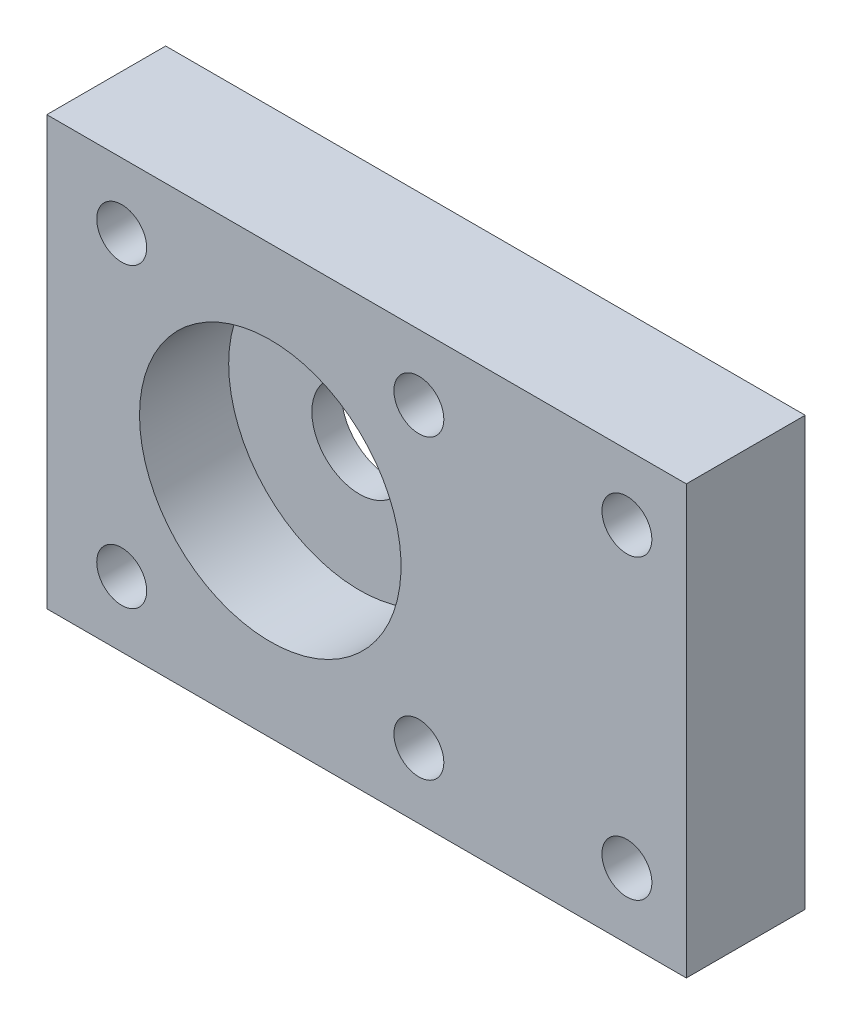
ISO-10303-21;
HEADER;
FILE_DESCRIPTION(('STEP AP214'),'2;1');
FILE_NAME('part.step','',(''),(''),'','','');
FILE_SCHEMA(('AUTOMOTIVE_DESIGN { 1 0 10303 214 1 1 1 1 }'));
ENDSEC;
DATA;
#1=APPLICATION_CONTEXT('core data for automotive mechanical design processes');
#2=APPLICATION_PROTOCOL_DEFINITION('international standard','automotive_design',2000,#1);
#3=PRODUCT_CONTEXT('',#1,'mechanical');
#4=PRODUCT('Part','Part','',(#3));
#5=PRODUCT_RELATED_PRODUCT_CATEGORY('part','',(#4));
#6=PRODUCT_DEFINITION_FORMATION('','',#4);
#7=PRODUCT_DEFINITION_CONTEXT('part definition',#1,'design');
#8=PRODUCT_DEFINITION('design','',#6,#7);
#9=PRODUCT_DEFINITION_SHAPE('','',#8);
#10=(LENGTH_UNIT() NAMED_UNIT(*) SI_UNIT(.MILLI.,.METRE.));
#11=(NAMED_UNIT(*) PLANE_ANGLE_UNIT() SI_UNIT($,.RADIAN.));
#12=(NAMED_UNIT(*) SI_UNIT($,.STERADIAN.) SOLID_ANGLE_UNIT());
#13=UNCERTAINTY_MEASURE_WITH_UNIT(LENGTH_MEASURE(1.E-05),#10,'distance_accuracy_value','');
#14=(GEOMETRIC_REPRESENTATION_CONTEXT(3) GLOBAL_UNCERTAINTY_ASSIGNED_CONTEXT((#13)) GLOBAL_UNIT_ASSIGNED_CONTEXT((#10,
#11,#12)) REPRESENTATION_CONTEXT('',''));
#15=CARTESIAN_POINT('',(0.,0.,0.));
#16=DIRECTION('',(0.,0.,1.));
#17=DIRECTION('',(1.,0.,0.));
#18=AXIS2_PLACEMENT_3D('',#15,#16,#17);
#19=CARTESIAN_POINT('',(0.,0.,-10.));
#20=DIRECTION('',(0.,0.,-1.));
#21=DIRECTION('',(1.,0.,0.));
#22=AXIS2_PLACEMENT_3D('',#19,#20,#21);
#23=PLANE('',#22);
#24=CARTESIAN_POINT('',(-5.,7.49999999999999,-10.));
#25=DIRECTION('',(0.,0.,1.));
#26=DIRECTION('',(-1.,0.,0.));
#27=AXIS2_PLACEMENT_3D('',#24,#25,#26);
#28=CIRCLE('',#27,2.1);
#29=CARTESIAN_POINT('',(-7.09999999999999,7.49999999999999,-10.));
#30=VERTEX_POINT('',#29);
#31=EDGE_CURVE('E116',#30,#30,#28,.T.);
#32=ORIENTED_EDGE('',*,*,#31,.T.);
#33=EDGE_LOOP('',(#32));
#34=FACE_BOUND('',#33,.T.);
#35=CARTESIAN_POINT('',(-22.5,7.5,-10.));
#36=DIRECTION('',(0.,0.,1.));
#37=DIRECTION('',(1.,0.,0.));
#38=AXIS2_PLACEMENT_3D('',#35,#36,#37);
#39=CIRCLE('',#38,2.1);
#40=CARTESIAN_POINT('',(-20.4,7.5,-10.));
#41=VERTEX_POINT('',#40);
#42=EDGE_CURVE('E128',#41,#41,#39,.T.);
#43=ORIENTED_EDGE('',*,*,#42,.T.);
#44=EDGE_LOOP('',(#43));
#45=FACE_BOUND('',#44,.T.);
#46=CARTESIAN_POINT('',(-47.5,7.49999999999998,-10.));
#47=DIRECTION('',(0.,0.,1.));
#48=DIRECTION('',(-1.,0.,0.));
#49=AXIS2_PLACEMENT_3D('',#46,#47,#48);
#50=CIRCLE('',#49,2.1);
#51=CARTESIAN_POINT('',(-49.6,7.49999999999998,-10.));
#52=VERTEX_POINT('',#51);
#53=EDGE_CURVE('E140',#52,#52,#50,.T.);
#54=ORIENTED_EDGE('',*,*,#53,.T.);
#55=EDGE_LOOP('',(#54));
#56=FACE_BOUND('',#55,.T.);
#57=CARTESIAN_POINT('',(-22.5,32.5,-10.));
#58=DIRECTION('',(0.,0.,1.));
#59=DIRECTION('',(1.,0.,0.));
#60=AXIS2_PLACEMENT_3D('',#57,#58,#59);
#61=CIRCLE('',#60,2.1);
#62=CARTESIAN_POINT('',(-20.4,32.5,-10.));
#63=VERTEX_POINT('',#62);
#64=EDGE_CURVE('E91',#63,#63,#61,.T.);
#65=ORIENTED_EDGE('',*,*,#64,.T.);
#66=EDGE_LOOP('',(#65));
#67=FACE_BOUND('',#66,.T.);
#68=CARTESIAN_POINT('',(-47.5,32.5,-10.));
#69=DIRECTION('',(0.,0.,1.));
#70=DIRECTION('',(1.,0.,0.));
#71=AXIS2_PLACEMENT_3D('',#68,#69,#70);
#72=CIRCLE('',#71,2.1);
#73=CARTESIAN_POINT('',(-45.4,32.5,-10.));
#74=VERTEX_POINT('',#73);
#75=EDGE_CURVE('E134',#74,#74,#72,.T.);
#76=ORIENTED_EDGE('',*,*,#75,.T.);
#77=EDGE_LOOP('',(#76));
#78=FACE_BOUND('',#77,.T.);
#79=CARTESIAN_POINT('',(-5.,32.5,-10.));
#80=DIRECTION('',(0.,0.,1.));
#81=DIRECTION('',(1.,0.,0.));
#82=AXIS2_PLACEMENT_3D('',#79,#80,#81);
#83=CIRCLE('',#82,2.1);
#84=CARTESIAN_POINT('',(-2.9,32.5,-10.));
#85=VERTEX_POINT('',#84);
#86=EDGE_CURVE('E122',#85,#85,#83,.T.);
#87=ORIENTED_EDGE('',*,*,#86,.T.);
#88=EDGE_LOOP('',(#87));
#89=FACE_BOUND('',#88,.T.);
#90=CARTESIAN_POINT('',(-35.,20.,-10.));
#91=DIRECTION('',(0.,0.,1.));
#92=DIRECTION('',(1.,0.,0.));
#93=AXIS2_PLACEMENT_3D('',#90,#91,#92);
#94=CIRCLE('',#93,4.);
#95=CARTESIAN_POINT('',(-31.,20.,-10.));
#96=VERTEX_POINT('',#95);
#97=EDGE_CURVE('E112',#96,#96,#94,.T.);
#98=ORIENTED_EDGE('',*,*,#97,.T.);
#99=EDGE_LOOP('',(#98));
#100=FACE_BOUND('',#99,.T.);
#101=DIRECTION('',(0.,1.,0.));
#102=VECTOR('',#101,1.);
#103=CARTESIAN_POINT('',(0.,0.,-10.));
#104=LINE('',#103,#102);
#105=CARTESIAN_POINT('',(0.,2.,-10.));
#106=VERTEX_POINT('',#105);
#107=CARTESIAN_POINT('',(0.,38.,-10.));
#108=VERTEX_POINT('',#107);
#109=EDGE_CURVE('E42',#106,#108,#104,.T.);
#110=ORIENTED_EDGE('',*,*,#109,.F.);
#111=DIRECTION('',(-1.,0.,0.));
#112=VECTOR('',#111,1.);
#113=CARTESIAN_POINT('',(0.,2.,-10.));
#114=LINE('',#113,#112);
#115=CARTESIAN_POINT('',(-53.8,2.,-10.));
#116=VERTEX_POINT('',#115);
#117=EDGE_CURVE('E103',#106,#116,#114,.T.);
#118=ORIENTED_EDGE('',*,*,#117,.T.);
#119=DIRECTION('',(0.,-1.,0.));
#120=VECTOR('',#119,1.);
#121=CARTESIAN_POINT('',(-53.8,0.,-10.));
#122=LINE('',#121,#120);
#123=CARTESIAN_POINT('',(-53.8,38.,-10.));
#124=VERTEX_POINT('',#123);
#125=EDGE_CURVE('E11',#124,#116,#122,.T.);
#126=ORIENTED_EDGE('',*,*,#125,.F.);
#127=DIRECTION('',(1.,0.,0.));
#128=VECTOR('',#127,1.);
#129=CARTESIAN_POINT('',(-53.8,38.,-10.));
#130=LINE('',#129,#128);
#131=EDGE_CURVE('E95',#124,#108,#130,.T.);
#132=ORIENTED_EDGE('',*,*,#131,.T.);
#133=EDGE_LOOP('',(#110,#118,#126,#132));
#134=FACE_BOUND('',#133,.T.);
#135=ADVANCED_FACE('F33',(#34,#45,#56,#67,#78,#89,#100,#134),#23,.T.);
#136=CARTESIAN_POINT('',(0.,0.,0.));
#137=DIRECTION('',(0.,0.,-1.));
#138=DIRECTION('',(1.,0.,0.));
#139=AXIS2_PLACEMENT_3D('',#136,#137,#138);
#140=PLANE('',#139);
#141=CARTESIAN_POINT('',(-34.9999999999993,19.9999999999776,0.));
#142=DIRECTION('',(0.,0.,-1.));
#143=DIRECTION('',(-1.,0.,0.));
#144=AXIS2_PLACEMENT_3D('',#141,#142,#143);
#145=CIRCLE('',#144,11.0000000000071);
#146=CARTESIAN_POINT('',(-46.0000000000064,19.9999999999776,0.));
#147=VERTEX_POINT('',#146);
#148=EDGE_CURVE('E106',#147,#147,#145,.T.);
#149=ORIENTED_EDGE('',*,*,#148,.T.);
#150=EDGE_LOOP('',(#149));
#151=FACE_BOUND('',#150,.T.);
#152=CARTESIAN_POINT('',(-22.5,32.5,0.));
#153=DIRECTION('',(0.,0.,1.));
#154=DIRECTION('',(1.,0.,0.));
#155=AXIS2_PLACEMENT_3D('',#152,#153,#154);
#156=CIRCLE('',#155,2.1);
#157=CARTESIAN_POINT('',(-20.4,32.5,0.));
#158=VERTEX_POINT('',#157);
#159=EDGE_CURVE('E143',#158,#158,#156,.T.);
#160=ORIENTED_EDGE('',*,*,#159,.F.);
#161=EDGE_LOOP('',(#160));
#162=FACE_BOUND('',#161,.T.);
#163=CARTESIAN_POINT('',(-47.5,7.49999999999998,0.));
#164=DIRECTION('',(0.,0.,1.));
#165=DIRECTION('',(-1.,0.,0.));
#166=AXIS2_PLACEMENT_3D('',#163,#164,#165);
#167=CIRCLE('',#166,2.1);
#168=CARTESIAN_POINT('',(-49.6,7.49999999999998,0.));
#169=VERTEX_POINT('',#168);
#170=EDGE_CURVE('E137',#169,#169,#167,.T.);
#171=ORIENTED_EDGE('',*,*,#170,.F.);
#172=EDGE_LOOP('',(#171));
#173=FACE_BOUND('',#172,.T.);
#174=CARTESIAN_POINT('',(-47.5,32.5,0.));
#175=DIRECTION('',(0.,0.,1.));
#176=DIRECTION('',(1.,0.,0.));
#177=AXIS2_PLACEMENT_3D('',#174,#175,#176);
#178=CIRCLE('',#177,2.1);
#179=CARTESIAN_POINT('',(-45.4,32.5,0.));
#180=VERTEX_POINT('',#179);
#181=EDGE_CURVE('E131',#180,#180,#178,.T.);
#182=ORIENTED_EDGE('',*,*,#181,.F.);
#183=EDGE_LOOP('',(#182));
#184=FACE_BOUND('',#183,.T.);
#185=CARTESIAN_POINT('',(-22.5,7.5,0.));
#186=DIRECTION('',(0.,0.,1.));
#187=DIRECTION('',(1.,0.,0.));
#188=AXIS2_PLACEMENT_3D('',#185,#186,#187);
#189=CIRCLE('',#188,2.1);
#190=CARTESIAN_POINT('',(-20.4,7.5,0.));
#191=VERTEX_POINT('',#190);
#192=EDGE_CURVE('E125',#191,#191,#189,.T.);
#193=ORIENTED_EDGE('',*,*,#192,.F.);
#194=EDGE_LOOP('',(#193));
#195=FACE_BOUND('',#194,.T.);
#196=CARTESIAN_POINT('',(-5.,32.5,0.));
#197=DIRECTION('',(0.,0.,1.));
#198=DIRECTION('',(1.,0.,0.));
#199=AXIS2_PLACEMENT_3D('',#196,#197,#198);
#200=CIRCLE('',#199,2.1);
#201=CARTESIAN_POINT('',(-2.9,32.5,0.));
#202=VERTEX_POINT('',#201);
#203=EDGE_CURVE('E119',#202,#202,#200,.T.);
#204=ORIENTED_EDGE('',*,*,#203,.F.);
#205=EDGE_LOOP('',(#204));
#206=FACE_BOUND('',#205,.T.);
#207=CARTESIAN_POINT('',(-5.,7.49999999999999,0.));
#208=DIRECTION('',(0.,0.,1.));
#209=DIRECTION('',(-1.,0.,0.));
#210=AXIS2_PLACEMENT_3D('',#207,#208,#209);
#211=CIRCLE('',#210,2.1);
#212=CARTESIAN_POINT('',(-7.09999999999999,7.49999999999999,0.));
#213=VERTEX_POINT('',#212);
#214=EDGE_CURVE('E115',#213,#213,#211,.T.);
#215=ORIENTED_EDGE('',*,*,#214,.F.);
#216=EDGE_LOOP('',(#215));
#217=FACE_BOUND('',#216,.T.);
#218=DIRECTION('',(-1.,0.,0.));
#219=VECTOR('',#218,1.);
#220=CARTESIAN_POINT('',(0.,38.,0.));
#221=LINE('',#220,#219);
#222=CARTESIAN_POINT('',(0.,38.,0.));
#223=VERTEX_POINT('',#222);
#224=CARTESIAN_POINT('',(-53.8,38.,0.));
#225=VERTEX_POINT('',#224);
#226=EDGE_CURVE('E83',#223,#225,#221,.T.);
#227=ORIENTED_EDGE('',*,*,#226,.T.);
#228=DIRECTION('',(0.,-1.,0.));
#229=VECTOR('',#228,1.);
#230=CARTESIAN_POINT('',(-53.8,0.,0.));
#231=LINE('',#230,#229);
#232=CARTESIAN_POINT('',(-53.8,2.,0.));
#233=VERTEX_POINT('',#232);
#234=EDGE_CURVE('E90',#225,#233,#231,.T.);
#235=ORIENTED_EDGE('',*,*,#234,.T.);
#236=DIRECTION('',(1.,0.,0.));
#237=VECTOR('',#236,1.);
#238=CARTESIAN_POINT('',(-53.8,2.,0.));
#239=LINE('',#238,#237);
#240=CARTESIAN_POINT('',(0.,2.,0.));
#241=VERTEX_POINT('',#240);
#242=EDGE_CURVE('E89',#233,#241,#239,.T.);
#243=ORIENTED_EDGE('',*,*,#242,.T.);
#244=DIRECTION('',(0.,1.,0.));
#245=VECTOR('',#244,1.);
#246=CARTESIAN_POINT('',(0.,0.,0.));
#247=LINE('',#246,#245);
#248=EDGE_CURVE('E79',#241,#223,#247,.T.);
#249=ORIENTED_EDGE('',*,*,#248,.T.);
#250=EDGE_LOOP('',(#227,#235,#243,#249));
#251=FACE_BOUND('',#250,.T.);
#252=ADVANCED_FACE('F87',(#151,#162,#173,#184,#195,#206,#217,#251),#140,.F.);
#253=CARTESIAN_POINT('',(0.,0.,-10.));
#254=DIRECTION('',(-1.,0.,0.));
#255=DIRECTION('',(0.,0.,-1.));
#256=AXIS2_PLACEMENT_3D('',#253,#254,#255);
#257=PLANE('',#256);
#258=DIRECTION('',(0.,0.,1.));
#259=VECTOR('',#258,1.);
#260=CARTESIAN_POINT('',(0.,38.,-10.));
#261=LINE('',#260,#259);
#262=EDGE_CURVE('E77',#108,#223,#261,.T.);
#263=ORIENTED_EDGE('',*,*,#262,.T.);
#264=ORIENTED_EDGE('',*,*,#248,.F.);
#265=DIRECTION('',(0.,0.,-1.));
#266=VECTOR('',#265,1.);
#267=CARTESIAN_POINT('',(0.,2.,0.));
#268=LINE('',#267,#266);
#269=EDGE_CURVE('E101',#241,#106,#268,.T.);
#270=ORIENTED_EDGE('',*,*,#269,.T.);
#271=ORIENTED_EDGE('',*,*,#109,.T.);
#272=EDGE_LOOP('',(#263,#264,#270,#271));
#273=FACE_BOUND('',#272,.T.);
#274=ADVANCED_FACE('F35',(#273),#257,.F.);
#275=CARTESIAN_POINT('',(-53.8,0.,-10.));
#276=DIRECTION('',(1.,0.,0.));
#277=DIRECTION('',(0.,0.,1.));
#278=AXIS2_PLACEMENT_3D('',#275,#276,#277);
#279=PLANE('',#278);
#280=DIRECTION('',(0.,0.,-1.));
#281=VECTOR('',#280,1.);
#282=CARTESIAN_POINT('',(-53.8,38.,0.));
#283=LINE('',#282,#281);
#284=EDGE_CURVE('E50',#225,#124,#283,.T.);
#285=ORIENTED_EDGE('',*,*,#284,.T.);
#286=ORIENTED_EDGE('',*,*,#125,.T.);
#287=DIRECTION('',(0.,0.,1.));
#288=VECTOR('',#287,1.);
#289=CARTESIAN_POINT('',(-53.8,2.,-10.));
#290=LINE('',#289,#288);
#291=EDGE_CURVE('E58',#116,#233,#290,.T.);
#292=ORIENTED_EDGE('',*,*,#291,.T.);
#293=ORIENTED_EDGE('',*,*,#234,.F.);
#294=EDGE_LOOP('',(#285,#286,#292,#293));
#295=FACE_BOUND('',#294,.T.);
#296=ADVANCED_FACE('F151',(#295),#279,.F.);
#297=CARTESIAN_POINT('',(-35.,20.,-10.));
#298=DIRECTION('',(0.,0.,1.));
#299=DIRECTION('',(-1.,0.,0.));
#300=AXIS2_PLACEMENT_3D('',#297,#298,#299);
#301=CYLINDRICAL_SURFACE('',#300,4.);
#302=ORIENTED_EDGE('',*,*,#97,.F.);
#303=EDGE_LOOP('',(#302));
#304=FACE_BOUND('',#303,.T.);
#305=CARTESIAN_POINT('',(-35.,20.,-7.5));
#306=DIRECTION('',(0.,0.,-1.));
#307=DIRECTION('',(-1.,0.,0.));
#308=AXIS2_PLACEMENT_3D('',#305,#306,#307);
#309=CIRCLE('',#308,4.);
#310=CARTESIAN_POINT('',(-39.,20.,-7.5));
#311=VERTEX_POINT('',#310);
#312=EDGE_CURVE('E37',#311,#311,#309,.T.);
#313=ORIENTED_EDGE('',*,*,#312,.F.);
#314=EDGE_LOOP('',(#313));
#315=FACE_BOUND('',#314,.T.);
#316=ADVANCED_FACE('F168',(#304,#315),#301,.F.);
#317=CARTESIAN_POINT('',(-22.5,32.5,-10.));
#318=DIRECTION('',(0.,0.,1.));
#319=DIRECTION('',(-1.,0.,0.));
#320=AXIS2_PLACEMENT_3D('',#317,#318,#319);
#321=CYLINDRICAL_SURFACE('',#320,2.1);
#322=ORIENTED_EDGE('',*,*,#64,.F.);
#323=EDGE_LOOP('',(#322));
#324=FACE_BOUND('',#323,.T.);
#325=ORIENTED_EDGE('',*,*,#159,.T.);
#326=EDGE_LOOP('',(#325));
#327=FACE_BOUND('',#326,.T.);
#328=ADVANCED_FACE('F165',(#324,#327),#321,.F.);
#329=CARTESIAN_POINT('',(-47.5,7.49999999999998,-10.));
#330=DIRECTION('',(0.,0.,1.));
#331=DIRECTION('',(-1.,0.,0.));
#332=AXIS2_PLACEMENT_3D('',#329,#330,#331);
#333=CYLINDRICAL_SURFACE('',#332,2.1);
#334=ORIENTED_EDGE('',*,*,#53,.F.);
#335=EDGE_LOOP('',(#334));
#336=FACE_BOUND('',#335,.T.);
#337=ORIENTED_EDGE('',*,*,#170,.T.);
#338=EDGE_LOOP('',(#337));
#339=FACE_BOUND('',#338,.T.);
#340=ADVANCED_FACE('F206',(#336,#339),#333,.F.);
#341=CARTESIAN_POINT('',(-47.5,32.5,-10.));
#342=DIRECTION('',(0.,0.,1.));
#343=DIRECTION('',(-1.,0.,0.));
#344=AXIS2_PLACEMENT_3D('',#341,#342,#343);
#345=CYLINDRICAL_SURFACE('',#344,2.1);
#346=ORIENTED_EDGE('',*,*,#75,.F.);
#347=EDGE_LOOP('',(#346));
#348=FACE_BOUND('',#347,.T.);
#349=ORIENTED_EDGE('',*,*,#181,.T.);
#350=EDGE_LOOP('',(#349));
#351=FACE_BOUND('',#350,.T.);
#352=ADVANCED_FACE('F214',(#348,#351),#345,.F.);
#353=CARTESIAN_POINT('',(-22.5,7.5,-10.));
#354=DIRECTION('',(0.,0.,1.));
#355=DIRECTION('',(-1.,0.,0.));
#356=AXIS2_PLACEMENT_3D('',#353,#354,#355);
#357=CYLINDRICAL_SURFACE('',#356,2.1);
#358=ORIENTED_EDGE('',*,*,#42,.F.);
#359=EDGE_LOOP('',(#358));
#360=FACE_BOUND('',#359,.T.);
#361=ORIENTED_EDGE('',*,*,#192,.T.);
#362=EDGE_LOOP('',(#361));
#363=FACE_BOUND('',#362,.T.);
#364=ADVANCED_FACE('F222',(#360,#363),#357,.F.);
#365=CARTESIAN_POINT('',(-5.,32.5,-10.));
#366=DIRECTION('',(0.,0.,1.));
#367=DIRECTION('',(-1.,0.,0.));
#368=AXIS2_PLACEMENT_3D('',#365,#366,#367);
#369=CYLINDRICAL_SURFACE('',#368,2.1);
#370=ORIENTED_EDGE('',*,*,#86,.F.);
#371=EDGE_LOOP('',(#370));
#372=FACE_BOUND('',#371,.T.);
#373=ORIENTED_EDGE('',*,*,#203,.T.);
#374=EDGE_LOOP('',(#373));
#375=FACE_BOUND('',#374,.T.);
#376=ADVANCED_FACE('F231',(#372,#375),#369,.F.);
#377=CARTESIAN_POINT('',(-5.,7.49999999999999,-10.));
#378=DIRECTION('',(0.,0.,1.));
#379=DIRECTION('',(-1.,0.,0.));
#380=AXIS2_PLACEMENT_3D('',#377,#378,#379);
#381=CYLINDRICAL_SURFACE('',#380,2.1);
#382=ORIENTED_EDGE('',*,*,#31,.F.);
#383=EDGE_LOOP('',(#382));
#384=FACE_BOUND('',#383,.T.);
#385=ORIENTED_EDGE('',*,*,#214,.T.);
#386=EDGE_LOOP('',(#385));
#387=FACE_BOUND('',#386,.T.);
#388=ADVANCED_FACE('F240',(#384,#387),#381,.F.);
#389=CARTESIAN_POINT('',(-34.9999999999993,19.9999999999776,-7.5));
#390=DIRECTION('',(0.,0.,1.));
#391=DIRECTION('',(-1.,0.,0.));
#392=AXIS2_PLACEMENT_3D('',#389,#390,#391);
#393=CYLINDRICAL_SURFACE('',#392,11.0000000000071);
#394=CARTESIAN_POINT('',(-34.9999999999993,19.9999999999776,-7.5));
#395=DIRECTION('',(0.,0.,-1.));
#396=DIRECTION('',(-1.,0.,0.));
#397=AXIS2_PLACEMENT_3D('',#394,#395,#396);
#398=CIRCLE('',#397,11.0000000000071);
#399=CARTESIAN_POINT('',(-46.0000000000064,19.9999999999776,-7.5));
#400=VERTEX_POINT('',#399);
#401=EDGE_CURVE('E107',#400,#400,#398,.T.);
#402=ORIENTED_EDGE('',*,*,#401,.T.);
#403=EDGE_LOOP('',(#402));
#404=FACE_BOUND('',#403,.T.);
#405=ORIENTED_EDGE('',*,*,#148,.F.);
#406=EDGE_LOOP('',(#405));
#407=FACE_BOUND('',#406,.T.);
#408=ADVANCED_FACE('F249',(#404,#407),#393,.F.);
#409=CARTESIAN_POINT('',(-34.9999999999993,19.9999999999776,-7.5));
#410=DIRECTION('',(0.,0.,1.));
#411=DIRECTION('',(-1.,0.,0.));
#412=AXIS2_PLACEMENT_3D('',#409,#410,#411);
#413=PLANE('',#412);
#414=ORIENTED_EDGE('',*,*,#312,.T.);
#415=EDGE_LOOP('',(#414));
#416=FACE_BOUND('',#415,.T.);
#417=ORIENTED_EDGE('',*,*,#401,.F.);
#418=EDGE_LOOP('',(#417));
#419=FACE_BOUND('',#418,.T.);
#420=ADVANCED_FACE('F258',(#416,#419),#413,.T.);
#421=CARTESIAN_POINT('',(0.,2.,0.));
#422=DIRECTION('',(0.,-1.,0.));
#423=DIRECTION('',(0.,0.,1.));
#424=AXIS2_PLACEMENT_3D('',#421,#422,#423);
#425=PLANE('',#424);
#426=ORIENTED_EDGE('',*,*,#291,.F.);
#427=ORIENTED_EDGE('',*,*,#117,.F.);
#428=ORIENTED_EDGE('',*,*,#269,.F.);
#429=ORIENTED_EDGE('',*,*,#242,.F.);
#430=EDGE_LOOP('',(#426,#427,#428,#429));
#431=FACE_BOUND('',#430,.T.);
#432=ADVANCED_FACE('F153',(#431),#425,.T.);
#433=CARTESIAN_POINT('',(0.,38.,0.));
#434=DIRECTION('',(0.,1.,0.));
#435=DIRECTION('',(-1.,0.,0.));
#436=AXIS2_PLACEMENT_3D('',#433,#434,#435);
#437=PLANE('',#436);
#438=ORIENTED_EDGE('',*,*,#262,.F.);
#439=ORIENTED_EDGE('',*,*,#131,.F.);
#440=ORIENTED_EDGE('',*,*,#284,.F.);
#441=ORIENTED_EDGE('',*,*,#226,.F.);
#442=EDGE_LOOP('',(#438,#439,#440,#441));
#443=FACE_BOUND('',#442,.T.);
#444=ADVANCED_FACE('F93',(#443),#437,.T.);
#445=CLOSED_SHELL('',(#135,#252,#274,#296,#316,#328,#340,#352,#364,#376,#388,#408,#420,#432,#444));
#446=MANIFOLD_SOLID_BREP('B2',#445);
#447=ADVANCED_BREP_SHAPE_REPRESENTATION('',(#18,#446),#14);
#448=SHAPE_DEFINITION_REPRESENTATION(#9,#447);
ENDSEC;
END-ISO-10303-21;
